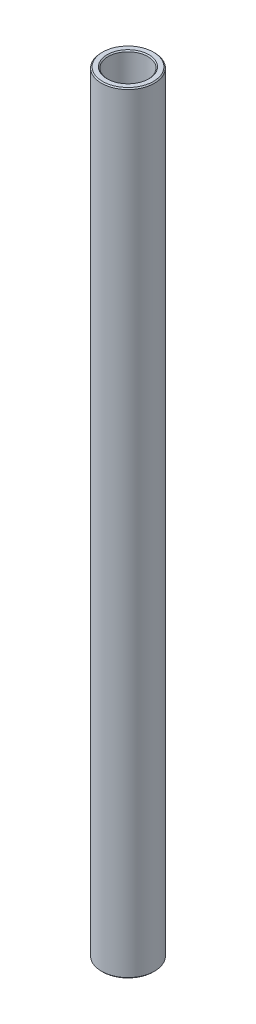
ISO-10303-21;
HEADER;
FILE_DESCRIPTION(('STEP AP214'),'2;1');
FILE_NAME('part.step','',(''),(''),'','','');
FILE_SCHEMA(('AUTOMOTIVE_DESIGN { 1 0 10303 214 1 1 1 1 }'));
ENDSEC;
DATA;
#1=APPLICATION_CONTEXT('core data for automotive mechanical design processes');
#2=APPLICATION_PROTOCOL_DEFINITION('international standard','automotive_design',2000,#1);
#3=PRODUCT_CONTEXT('',#1,'mechanical');
#4=PRODUCT('Part','Part','',(#3));
#5=PRODUCT_RELATED_PRODUCT_CATEGORY('part','',(#4));
#6=PRODUCT_DEFINITION_FORMATION('','',#4);
#7=PRODUCT_DEFINITION_CONTEXT('part definition',#1,'design');
#8=PRODUCT_DEFINITION('design','',#6,#7);
#9=PRODUCT_DEFINITION_SHAPE('','',#8);
#10=(LENGTH_UNIT() NAMED_UNIT(*) SI_UNIT(.MILLI.,.METRE.));
#11=(NAMED_UNIT(*) PLANE_ANGLE_UNIT() SI_UNIT($,.RADIAN.));
#12=(NAMED_UNIT(*) SI_UNIT($,.STERADIAN.) SOLID_ANGLE_UNIT());
#13=UNCERTAINTY_MEASURE_WITH_UNIT(LENGTH_MEASURE(1.E-05),#10,'distance_accuracy_value','');
#14=(GEOMETRIC_REPRESENTATION_CONTEXT(3) GLOBAL_UNCERTAINTY_ASSIGNED_CONTEXT((#13)) GLOBAL_UNIT_ASSIGNED_CONTEXT((#10,
#11,#12)) REPRESENTATION_CONTEXT('',''));
#15=CARTESIAN_POINT('',(0.,0.,0.));
#16=DIRECTION('',(0.,0.,1.));
#17=DIRECTION('',(1.,0.,0.));
#18=AXIS2_PLACEMENT_3D('',#15,#16,#17);
#19=CARTESIAN_POINT('',(0.,11.60859375,0.));
#20=DIRECTION('',(0.,1.,0.));
#21=DIRECTION('',(-1.,0.,0.));
#22=AXIS2_PLACEMENT_3D('',#19,#20,#21);
#23=CYLINDRICAL_SURFACE('',#22,4.7625);
#24=CARTESIAN_POINT('',(0.,-92.217875,0.));
#25=DIRECTION('',(0.,1.,0.));
#26=DIRECTION('',(-1.,0.,0.));
#27=AXIS2_PLACEMENT_3D('',#24,#25,#26);
#28=CIRCLE('',#27,4.7625);
#29=CARTESIAN_POINT('',(-4.76250000000001,-92.217875,0.));
#30=VERTEX_POINT('',#29);
#31=EDGE_CURVE('E50',#30,#30,#28,.F.);
#32=ORIENTED_EDGE('',*,*,#31,.T.);
#33=EDGE_LOOP('',(#32));
#34=FACE_BOUND('',#33,.T.);
#35=CARTESIAN_POINT('',(0.,92.217875,0.));
#36=DIRECTION('',(0.,-1.,0.));
#37=DIRECTION('',(1.,0.,0.));
#38=AXIS2_PLACEMENT_3D('',#35,#36,#37);
#39=CIRCLE('',#38,4.7625);
#40=CARTESIAN_POINT('',(4.76250000000001,92.217875,0.));
#41=VERTEX_POINT('',#40);
#42=EDGE_CURVE('E53',#41,#41,#39,.F.);
#43=ORIENTED_EDGE('',*,*,#42,.T.);
#44=EDGE_LOOP('',(#43));
#45=FACE_BOUND('',#44,.T.);
#46=ADVANCED_FACE('F30',(#34,#45),#23,.F.);
#47=CARTESIAN_POINT('',(4.76249999999999,92.471875,0.));
#48=DIRECTION('',(0.,-1.,0.));
#49=DIRECTION('',(1.,0.,0.));
#50=AXIS2_PLACEMENT_3D('',#47,#48,#49);
#51=PLANE('',#50);
#52=CARTESIAN_POINT('',(0.,92.471875,0.));
#53=DIRECTION('',(0.,-1.,0.));
#54=DIRECTION('',(1.,0.,0.));
#55=AXIS2_PLACEMENT_3D('',#52,#53,#54);
#56=CIRCLE('',#55,6.09600000000002);
#57=CARTESIAN_POINT('',(6.09600000000003,92.471875,0.));
#58=VERTEX_POINT('',#57);
#59=EDGE_CURVE('E10',#58,#58,#56,.F.);
#60=ORIENTED_EDGE('',*,*,#59,.T.);
#61=EDGE_LOOP('',(#60));
#62=FACE_BOUND('',#61,.T.);
#63=CARTESIAN_POINT('',(0.,92.471875,0.));
#64=DIRECTION('',(0.,-1.,0.));
#65=DIRECTION('',(1.,0.,0.));
#66=AXIS2_PLACEMENT_3D('',#63,#64,#65);
#67=CIRCLE('',#66,5.01649999999998);
#68=CARTESIAN_POINT('',(5.01649999999999,92.471875,0.));
#69=VERTEX_POINT('',#68);
#70=EDGE_CURVE('E37',#69,#69,#67,.T.);
#71=ORIENTED_EDGE('',*,*,#70,.T.);
#72=EDGE_LOOP('',(#71));
#73=FACE_BOUND('',#72,.T.);
#74=ADVANCED_FACE('F76',(#62,#73),#51,.F.);
#75=CARTESIAN_POINT('',(0.,11.60859375,0.));
#76=DIRECTION('',(0.,1.,0.));
#77=DIRECTION('',(-1.,0.,0.));
#78=AXIS2_PLACEMENT_3D('',#75,#76,#77);
#79=CYLINDRICAL_SURFACE('',#78,6.35);
#80=CARTESIAN_POINT('',(0.,-92.2178750000001,0.));
#81=DIRECTION('',(0.,1.,0.));
#82=DIRECTION('',(-1.,0.,0.));
#83=AXIS2_PLACEMENT_3D('',#80,#81,#82);
#84=CIRCLE('',#83,6.35);
#85=CARTESIAN_POINT('',(-6.35000000000001,-92.2178750000001,0.));
#86=VERTEX_POINT('',#85);
#87=EDGE_CURVE('E41',#86,#86,#84,.T.);
#88=ORIENTED_EDGE('',*,*,#87,.T.);
#89=EDGE_LOOP('',(#88));
#90=FACE_BOUND('',#89,.T.);
#91=CARTESIAN_POINT('',(0.,92.217875,0.));
#92=DIRECTION('',(0.,-1.,0.));
#93=DIRECTION('',(1.,0.,0.));
#94=AXIS2_PLACEMENT_3D('',#91,#92,#93);
#95=CIRCLE('',#94,6.35);
#96=CARTESIAN_POINT('',(6.35000000000001,92.217875,0.));
#97=VERTEX_POINT('',#96);
#98=EDGE_CURVE('E45',#97,#97,#95,.T.);
#99=ORIENTED_EDGE('',*,*,#98,.T.);
#100=EDGE_LOOP('',(#99));
#101=FACE_BOUND('',#100,.T.);
#102=ADVANCED_FACE('F73',(#90,#101),#79,.T.);
#103=CARTESIAN_POINT('',(6.35000000000001,-92.471875,0.));
#104=DIRECTION('',(0.,1.,0.));
#105=DIRECTION('',(-1.,0.,0.));
#106=AXIS2_PLACEMENT_3D('',#103,#104,#105);
#107=PLANE('',#106);
#108=CARTESIAN_POINT('',(0.,-92.471875,0.));
#109=DIRECTION('',(0.,1.,0.));
#110=DIRECTION('',(-1.,0.,0.));
#111=AXIS2_PLACEMENT_3D('',#108,#109,#110);
#112=CIRCLE('',#111,5.01650000000001);
#113=CARTESIAN_POINT('',(-5.01650000000002,-92.471875,0.));
#114=VERTEX_POINT('',#113);
#115=EDGE_CURVE('E56',#114,#114,#112,.T.);
#116=ORIENTED_EDGE('',*,*,#115,.T.);
#117=EDGE_LOOP('',(#116));
#118=FACE_BOUND('',#117,.T.);
#119=CARTESIAN_POINT('',(0.,-92.471875,0.));
#120=DIRECTION('',(0.,1.,0.));
#121=DIRECTION('',(-1.,0.,0.));
#122=AXIS2_PLACEMENT_3D('',#119,#120,#121);
#123=CIRCLE('',#122,6.0960000000001);
#124=CARTESIAN_POINT('',(-6.09600000000011,-92.471875,0.));
#125=VERTEX_POINT('',#124);
#126=EDGE_CURVE('E59',#125,#125,#123,.F.);
#127=ORIENTED_EDGE('',*,*,#126,.T.);
#128=EDGE_LOOP('',(#127));
#129=FACE_BOUND('',#128,.T.);
#130=ADVANCED_FACE('F63',(#118,#129),#107,.F.);
#131=CARTESIAN_POINT('',(0.,-92.471875,0.));
#132=DIRECTION('',(0.,-1.,0.));
#133=DIRECTION('',(1.,0.,0.));
#134=AXIS2_PLACEMENT_3D('',#131,#132,#133);
#135=CONICAL_SURFACE('',#134,5.01650000000001,0.785398163397423);
#136=ORIENTED_EDGE('',*,*,#31,.F.);
#137=EDGE_LOOP('',(#136));
#138=FACE_BOUND('',#137,.T.);
#139=ORIENTED_EDGE('',*,*,#115,.F.);
#140=EDGE_LOOP('',(#139));
#141=FACE_BOUND('',#140,.T.);
#142=ADVANCED_FACE('F69',(#138,#141),#135,.F.);
#143=CARTESIAN_POINT('',(0.,-92.2178750000001,0.));
#144=DIRECTION('',(0.,1.,0.));
#145=DIRECTION('',(-1.,0.,0.));
#146=AXIS2_PLACEMENT_3D('',#143,#144,#145);
#147=CONICAL_SURFACE('',#146,6.35,0.785398163397406);
#148=ORIENTED_EDGE('',*,*,#126,.F.);
#149=EDGE_LOOP('',(#148));
#150=FACE_BOUND('',#149,.T.);
#151=ORIENTED_EDGE('',*,*,#87,.F.);
#152=EDGE_LOOP('',(#151));
#153=FACE_BOUND('',#152,.T.);
#154=ADVANCED_FACE('F65',(#150,#153),#147,.T.);
#155=CARTESIAN_POINT('',(0.,92.471875,0.));
#156=DIRECTION('',(0.,-1.,0.));
#157=DIRECTION('',(1.,0.,0.));
#158=AXIS2_PLACEMENT_3D('',#155,#156,#157);
#159=CONICAL_SURFACE('',#158,6.09600000000002,0.785398163397406);
#160=ORIENTED_EDGE('',*,*,#98,.F.);
#161=EDGE_LOOP('',(#160));
#162=FACE_BOUND('',#161,.T.);
#163=ORIENTED_EDGE('',*,*,#59,.F.);
#164=EDGE_LOOP('',(#163));
#165=FACE_BOUND('',#164,.T.);
#166=ADVANCED_FACE('F68',(#162,#165),#159,.T.);
#167=CARTESIAN_POINT('',(0.,92.217875,0.));
#168=DIRECTION('',(0.,1.,0.));
#169=DIRECTION('',(-1.,0.,0.));
#170=AXIS2_PLACEMENT_3D('',#167,#168,#169);
#171=CONICAL_SURFACE('',#170,4.7625,0.785398163397423);
#172=ORIENTED_EDGE('',*,*,#70,.F.);
#173=EDGE_LOOP('',(#172));
#174=FACE_BOUND('',#173,.T.);
#175=ORIENTED_EDGE('',*,*,#42,.F.);
#176=EDGE_LOOP('',(#175));
#177=FACE_BOUND('',#176,.T.);
#178=ADVANCED_FACE('F32',(#174,#177),#171,.F.);
#179=CLOSED_SHELL('',(#46,#74,#102,#130,#142,#154,#166,#178));
#180=MANIFOLD_SOLID_BREP('B2',#179);
#181=ADVANCED_BREP_SHAPE_REPRESENTATION('',(#18,#180),#14);
#182=SHAPE_DEFINITION_REPRESENTATION(#9,#181);
ENDSEC;
END-ISO-10303-21;
